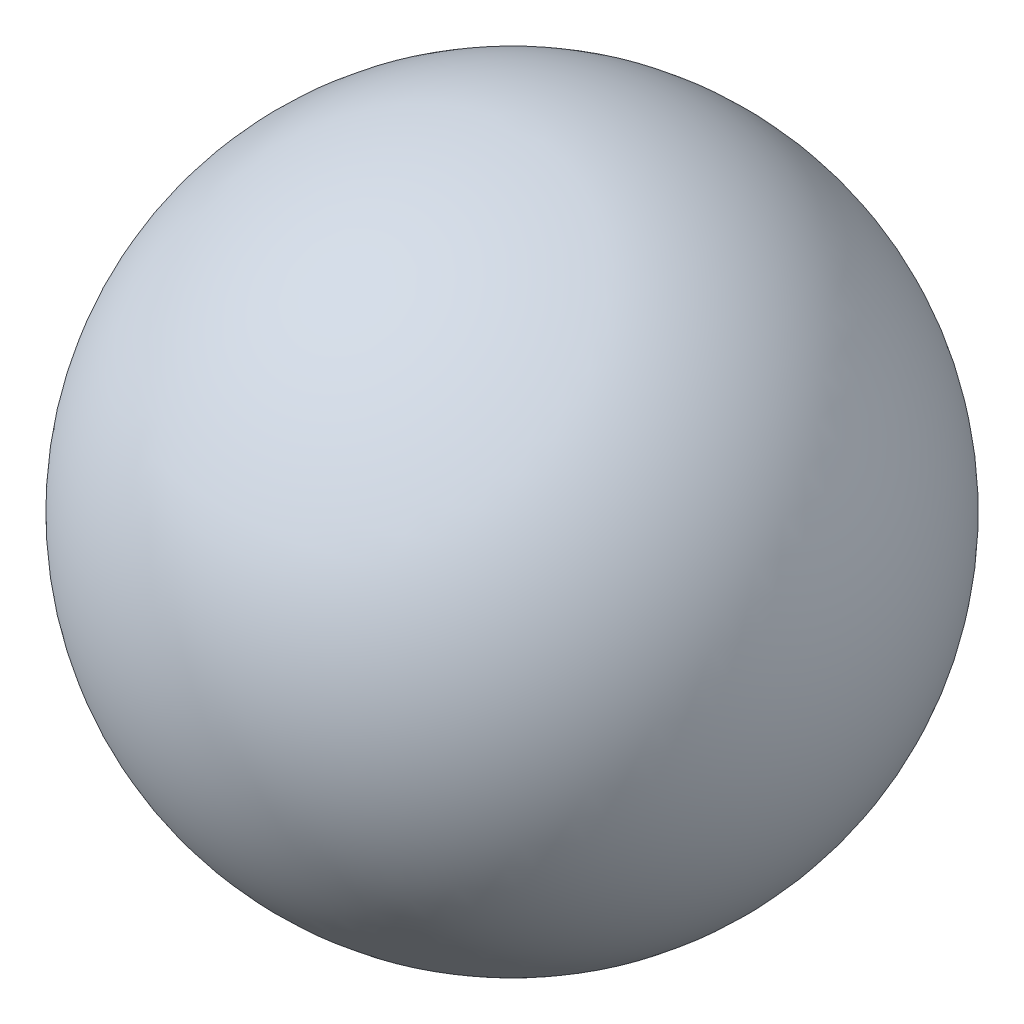
ISO-10303-21;
HEADER;
FILE_DESCRIPTION(('STEP AP214'),'2;1');
FILE_NAME('part.step','',(''),(''),'','','');
FILE_SCHEMA(('AUTOMOTIVE_DESIGN { 1 0 10303 214 1 1 1 1 }'));
ENDSEC;
DATA;
#1=APPLICATION_CONTEXT('core data for automotive mechanical design processes');
#2=APPLICATION_PROTOCOL_DEFINITION('international standard','automotive_design',2000,#1);
#3=PRODUCT_CONTEXT('',#1,'mechanical');
#4=PRODUCT('Part','Part','',(#3));
#5=PRODUCT_RELATED_PRODUCT_CATEGORY('part','',(#4));
#6=PRODUCT_DEFINITION_FORMATION('','',#4);
#7=PRODUCT_DEFINITION_CONTEXT('part definition',#1,'design');
#8=PRODUCT_DEFINITION('design','',#6,#7);
#9=PRODUCT_DEFINITION_SHAPE('','',#8);
#10=(LENGTH_UNIT() NAMED_UNIT(*) SI_UNIT(.MILLI.,.METRE.));
#11=(NAMED_UNIT(*) PLANE_ANGLE_UNIT() SI_UNIT($,.RADIAN.));
#12=(NAMED_UNIT(*) SI_UNIT($,.STERADIAN.) SOLID_ANGLE_UNIT());
#13=UNCERTAINTY_MEASURE_WITH_UNIT(LENGTH_MEASURE(1.E-05),#10,'distance_accuracy_value','');
#14=(GEOMETRIC_REPRESENTATION_CONTEXT(3) GLOBAL_UNCERTAINTY_ASSIGNED_CONTEXT((#13)) GLOBAL_UNIT_ASSIGNED_CONTEXT((#10,
#11,#12)) REPRESENTATION_CONTEXT('',''));
#15=CARTESIAN_POINT('',(0.,0.,0.));
#16=DIRECTION('',(0.,0.,1.));
#17=DIRECTION('',(1.,0.,0.));
#18=AXIS2_PLACEMENT_3D('',#15,#16,#17);
#19=CARTESIAN_POINT('',(0.,0.,0.));
#20=DIRECTION('',(0.,1.,0.));
#21=DIRECTION('',(1.,0.,0.));
#22=AXIS2_PLACEMENT_3D('',#19,#20,#21);
#23=SPHERICAL_SURFACE('',#22,15.);
#24=CARTESIAN_POINT('',(0.,15.,0.));
#25=VERTEX_POINT('',#24);
#26=VERTEX_LOOP('',#25);
#27=FACE_BOUND('',#26,.T.);
#28=ADVANCED_FACE('F33',(#27),#23,.T.);
#29=CLOSED_SHELL('',(#28));
#30=MANIFOLD_SOLID_BREP('B2',#29);
#31=ADVANCED_BREP_SHAPE_REPRESENTATION('',(#18,#30),#14);
#32=SHAPE_DEFINITION_REPRESENTATION(#9,#31);
ENDSEC;
END-ISO-10303-21;
